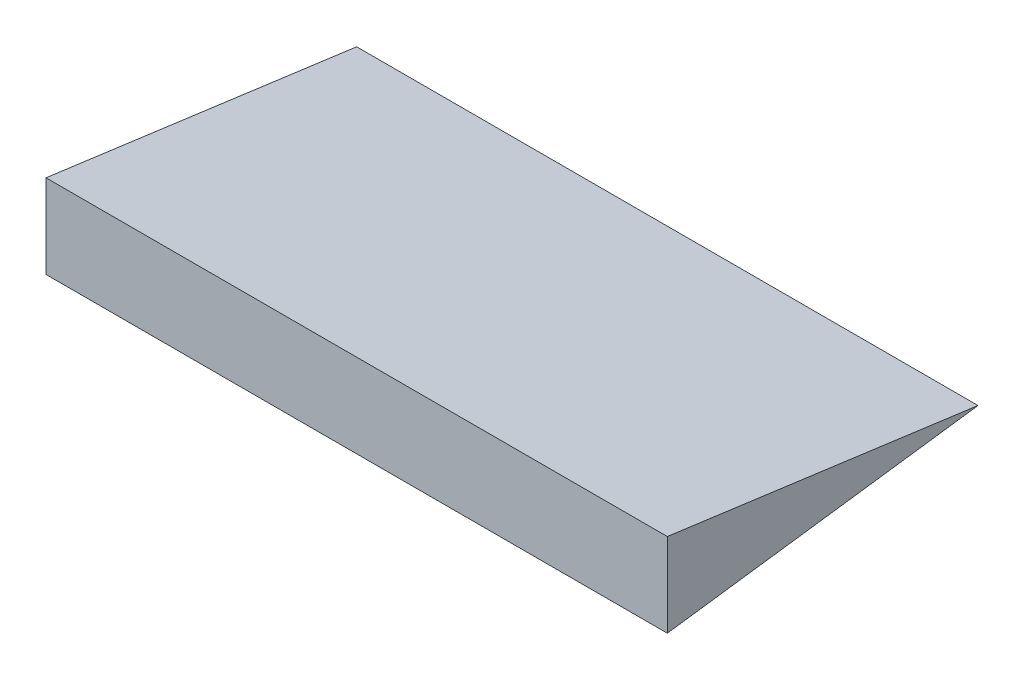
ISO-10303-21;
HEADER;
FILE_DESCRIPTION(('STEP AP214'),'2;1');
FILE_NAME('part.step','',(''),(''),'','','');
FILE_SCHEMA(('AUTOMOTIVE_DESIGN { 1 0 10303 214 1 1 1 1 }'));
ENDSEC;
DATA;
#1=APPLICATION_CONTEXT('core data for automotive mechanical design processes');
#2=APPLICATION_PROTOCOL_DEFINITION('international standard','automotive_design',2000,#1);
#3=PRODUCT_CONTEXT('',#1,'mechanical');
#4=PRODUCT('Part','Part','',(#3));
#5=PRODUCT_RELATED_PRODUCT_CATEGORY('part','',(#4));
#6=PRODUCT_DEFINITION_FORMATION('','',#4);
#7=PRODUCT_DEFINITION_CONTEXT('part definition',#1,'design');
#8=PRODUCT_DEFINITION('design','',#6,#7);
#9=PRODUCT_DEFINITION_SHAPE('','',#8);
#10=(LENGTH_UNIT() NAMED_UNIT(*) SI_UNIT(.MILLI.,.METRE.));
#11=(NAMED_UNIT(*) PLANE_ANGLE_UNIT() SI_UNIT($,.RADIAN.));
#12=(NAMED_UNIT(*) SI_UNIT($,.STERADIAN.) SOLID_ANGLE_UNIT());
#13=UNCERTAINTY_MEASURE_WITH_UNIT(LENGTH_MEASURE(1.E-05),#10,'distance_accuracy_value','');
#14=(GEOMETRIC_REPRESENTATION_CONTEXT(3) GLOBAL_UNCERTAINTY_ASSIGNED_CONTEXT((#13)) GLOBAL_UNIT_ASSIGNED_CONTEXT((#10,
#11,#12)) REPRESENTATION_CONTEXT('',''));
#15=CARTESIAN_POINT('',(0.,0.,0.));
#16=DIRECTION('',(0.,0.,1.));
#17=DIRECTION('',(1.,0.,0.));
#18=AXIS2_PLACEMENT_3D('',#15,#16,#17);
#19=CARTESIAN_POINT('',(50.,-6.73883674272328,50.));
#20=DIRECTION('',(0.,0.991039506706489,0.133569068825681));
#21=DIRECTION('',(0.,-0.133569068825681,0.991039506706489));
#22=AXIS2_PLACEMENT_3D('',#19,#20,#21);
#23=PLANE('',#22);
#24=DIRECTION('',(0.,0.133569068825681,-0.991039506706489));
#25=VECTOR('',#24,1.);
#26=CARTESIAN_POINT('',(-50.,-6.73883674272328,50.));
#27=LINE('',#26,#25);
#28=CARTESIAN_POINT('',(-50.,-6.73883674272328,50.));
#29=VERTEX_POINT('',#28);
#30=CARTESIAN_POINT('',(-50.,0.,0.));
#31=VERTEX_POINT('',#30);
#32=EDGE_CURVE('E83',#29,#31,#27,.T.);
#33=ORIENTED_EDGE('',*,*,#32,.T.);
#34=DIRECTION('',(-1.,0.,0.));
#35=VECTOR('',#34,1.);
#36=CARTESIAN_POINT('',(50.,0.,0.));
#37=LINE('',#36,#35);
#38=CARTESIAN_POINT('',(50.,0.,0.));
#39=VERTEX_POINT('',#38);
#40=EDGE_CURVE('E11',#39,#31,#37,.T.);
#41=ORIENTED_EDGE('',*,*,#40,.F.);
#42=DIRECTION('',(0.,0.133569068825681,-0.991039506706489));
#43=VECTOR('',#42,1.);
#44=CARTESIAN_POINT('',(50.,-6.73883674272328,50.));
#45=LINE('',#44,#43);
#46=CARTESIAN_POINT('',(50.,-6.73883674272328,50.));
#47=VERTEX_POINT('',#46);
#48=EDGE_CURVE('E76',#47,#39,#45,.T.);
#49=ORIENTED_EDGE('',*,*,#48,.F.);
#50=DIRECTION('',(-1.,0.,0.));
#51=VECTOR('',#50,1.);
#52=CARTESIAN_POINT('',(50.,-6.73883674272328,50.));
#53=LINE('',#52,#51);
#54=EDGE_CURVE('E84',#47,#29,#53,.T.);
#55=ORIENTED_EDGE('',*,*,#54,.T.);
#56=EDGE_LOOP('',(#33,#41,#49,#55));
#57=FACE_BOUND('',#56,.T.);
#58=ADVANCED_FACE('F36',(#57),#23,.F.);
#59=CARTESIAN_POINT('',(50.,6.73883674272328,50.));
#60=DIRECTION('',(0.,-0.991039506706489,0.133569068825681));
#61=DIRECTION('',(0.,-0.133569068825681,-0.991039506706489));
#62=AXIS2_PLACEMENT_3D('',#59,#60,#61);
#63=PLANE('',#62);
#64=DIRECTION('',(0.,0.133569068825681,0.991039506706489));
#65=VECTOR('',#64,1.);
#66=CARTESIAN_POINT('',(-50.,6.73883674272328,50.));
#67=LINE('',#66,#65);
#68=CARTESIAN_POINT('',(-50.,6.73883674272328,50.));
#69=VERTEX_POINT('',#68);
#70=EDGE_CURVE('E64',#31,#69,#67,.T.);
#71=ORIENTED_EDGE('',*,*,#70,.T.);
#72=DIRECTION('',(-1.,0.,0.));
#73=VECTOR('',#72,1.);
#74=CARTESIAN_POINT('',(50.,6.73883674272328,50.));
#75=LINE('',#74,#73);
#76=CARTESIAN_POINT('',(50.,6.73883674272328,50.));
#77=VERTEX_POINT('',#76);
#78=EDGE_CURVE('E44',#77,#69,#75,.T.);
#79=ORIENTED_EDGE('',*,*,#78,.F.);
#80=DIRECTION('',(0.,0.133569068825681,0.991039506706489));
#81=VECTOR('',#80,1.);
#82=CARTESIAN_POINT('',(50.,6.73883674272328,50.));
#83=LINE('',#82,#81);
#84=EDGE_CURVE('E72',#39,#77,#83,.T.);
#85=ORIENTED_EDGE('',*,*,#84,.F.);
#86=ORIENTED_EDGE('',*,*,#40,.T.);
#87=EDGE_LOOP('',(#71,#79,#85,#86));
#88=FACE_BOUND('',#87,.T.);
#89=ADVANCED_FACE('F73',(#88),#63,.F.);
#90=CARTESIAN_POINT('',(50.,-6.73883674272328,50.));
#91=DIRECTION('',(0.,0.,-1.));
#92=DIRECTION('',(-1.,0.,0.));
#93=AXIS2_PLACEMENT_3D('',#90,#91,#92);
#94=PLANE('',#93);
#95=DIRECTION('',(0.,-1.,0.));
#96=VECTOR('',#95,1.);
#97=CARTESIAN_POINT('',(-50.,-6.73883674272328,50.));
#98=LINE('',#97,#96);
#99=EDGE_CURVE('E69',#69,#29,#98,.T.);
#100=ORIENTED_EDGE('',*,*,#99,.T.);
#101=ORIENTED_EDGE('',*,*,#54,.F.);
#102=DIRECTION('',(0.,-1.,0.));
#103=VECTOR('',#102,1.);
#104=CARTESIAN_POINT('',(50.,-6.73883674272328,50.));
#105=LINE('',#104,#103);
#106=EDGE_CURVE('E52',#77,#47,#105,.T.);
#107=ORIENTED_EDGE('',*,*,#106,.F.);
#108=ORIENTED_EDGE('',*,*,#78,.T.);
#109=EDGE_LOOP('',(#100,#101,#107,#108));
#110=FACE_BOUND('',#109,.T.);
#111=ADVANCED_FACE('F91',(#110),#94,.F.);
#112=CARTESIAN_POINT('',(50.,0.,0.));
#113=DIRECTION('',(1.,0.,0.));
#114=DIRECTION('',(0.,0.,-1.));
#115=AXIS2_PLACEMENT_3D('',#112,#113,#114);
#116=PLANE('',#115);
#117=ORIENTED_EDGE('',*,*,#48,.T.);
#118=ORIENTED_EDGE('',*,*,#84,.T.);
#119=ORIENTED_EDGE('',*,*,#106,.T.);
#120=EDGE_LOOP('',(#117,#118,#119));
#121=FACE_BOUND('',#120,.T.);
#122=ADVANCED_FACE('F79',(#121),#116,.T.);
#123=CARTESIAN_POINT('',(-50.,0.,0.));
#124=DIRECTION('',(1.,0.,0.));
#125=DIRECTION('',(0.,0.,-1.));
#126=AXIS2_PLACEMENT_3D('',#123,#124,#125);
#127=PLANE('',#126);
#128=ORIENTED_EDGE('',*,*,#32,.F.);
#129=ORIENTED_EDGE('',*,*,#99,.F.);
#130=ORIENTED_EDGE('',*,*,#70,.F.);
#131=EDGE_LOOP('',(#128,#129,#130));
#132=FACE_BOUND('',#131,.T.);
#133=ADVANCED_FACE('F92',(#132),#127,.F.);
#134=CLOSED_SHELL('',(#58,#89,#111,#122,#133));
#135=MANIFOLD_SOLID_BREP('B2',#134);
#136=ADVANCED_BREP_SHAPE_REPRESENTATION('',(#18,#135),#14);
#137=SHAPE_DEFINITION_REPRESENTATION(#9,#136);
ENDSEC;
END-ISO-10303-21;
